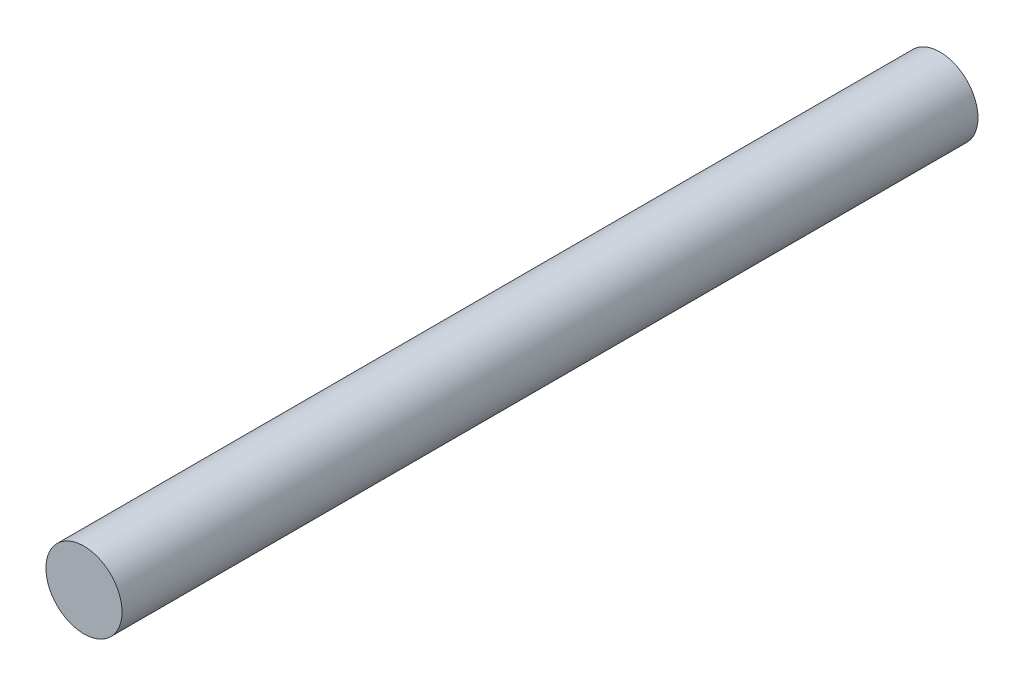
ISO-10303-21;
HEADER;
FILE_DESCRIPTION(('STEP AP214'),'2;1');
FILE_NAME('part.step','',(''),(''),'','','');
FILE_SCHEMA(('AUTOMOTIVE_DESIGN { 1 0 10303 214 1 1 1 1 }'));
ENDSEC;
DATA;
#1=APPLICATION_CONTEXT('core data for automotive mechanical design processes');
#2=APPLICATION_PROTOCOL_DEFINITION('international standard','automotive_design',2000,#1);
#3=PRODUCT_CONTEXT('',#1,'mechanical');
#4=PRODUCT('Part','Part','',(#3));
#5=PRODUCT_RELATED_PRODUCT_CATEGORY('part','',(#4));
#6=PRODUCT_DEFINITION_FORMATION('','',#4);
#7=PRODUCT_DEFINITION_CONTEXT('part definition',#1,'design');
#8=PRODUCT_DEFINITION('design','',#6,#7);
#9=PRODUCT_DEFINITION_SHAPE('','',#8);
#10=(LENGTH_UNIT() NAMED_UNIT(*) SI_UNIT(.MILLI.,.METRE.));
#11=(NAMED_UNIT(*) PLANE_ANGLE_UNIT() SI_UNIT($,.RADIAN.));
#12=(NAMED_UNIT(*) SI_UNIT($,.STERADIAN.) SOLID_ANGLE_UNIT());
#13=UNCERTAINTY_MEASURE_WITH_UNIT(LENGTH_MEASURE(1.E-05),#10,'distance_accuracy_value','');
#14=(GEOMETRIC_REPRESENTATION_CONTEXT(3) GLOBAL_UNCERTAINTY_ASSIGNED_CONTEXT((#13)) GLOBAL_UNIT_ASSIGNED_CONTEXT((#10,
#11,#12)) REPRESENTATION_CONTEXT('',''));
#15=CARTESIAN_POINT('',(0.,0.,0.));
#16=DIRECTION('',(0.,0.,1.));
#17=DIRECTION('',(1.,0.,0.));
#18=AXIS2_PLACEMENT_3D('',#15,#16,#17);
#19=CARTESIAN_POINT('',(0.,0.,45.));
#20=DIRECTION('',(0.,0.,-1.));
#21=DIRECTION('',(-1.,0.,0.));
#22=AXIS2_PLACEMENT_3D('',#19,#20,#21);
#23=CYLINDRICAL_SURFACE('',#22,2.);
#24=CARTESIAN_POINT('',(0.,0.,45.));
#25=DIRECTION('',(0.,0.,1.));
#26=DIRECTION('',(1.,0.,0.));
#27=AXIS2_PLACEMENT_3D('',#24,#25,#26);
#28=CIRCLE('',#27,2.);
#29=CARTESIAN_POINT('',(2.,0.,45.));
#30=VERTEX_POINT('',#29);
#31=EDGE_CURVE('E10',#30,#30,#28,.T.);
#32=ORIENTED_EDGE('',*,*,#31,.F.);
#33=EDGE_LOOP('',(#32));
#34=FACE_BOUND('',#33,.T.);
#35=CARTESIAN_POINT('',(0.,0.,0.));
#36=DIRECTION('',(0.,0.,1.));
#37=DIRECTION('',(1.,0.,0.));
#38=AXIS2_PLACEMENT_3D('',#35,#36,#37);
#39=CIRCLE('',#38,2.);
#40=CARTESIAN_POINT('',(2.,0.,0.));
#41=VERTEX_POINT('',#40);
#42=EDGE_CURVE('E33',#41,#41,#39,.T.);
#43=ORIENTED_EDGE('',*,*,#42,.T.);
#44=EDGE_LOOP('',(#43));
#45=FACE_BOUND('',#44,.T.);
#46=ADVANCED_FACE('F30',(#34,#45),#23,.T.);
#47=CARTESIAN_POINT('',(0.,0.,45.));
#48=DIRECTION('',(0.,0.,1.));
#49=DIRECTION('',(1.,0.,0.));
#50=AXIS2_PLACEMENT_3D('',#47,#48,#49);
#51=PLANE('',#50);
#52=ORIENTED_EDGE('',*,*,#31,.T.);
#53=EDGE_LOOP('',(#52));
#54=FACE_BOUND('',#53,.T.);
#55=ADVANCED_FACE('F45',(#54),#51,.T.);
#56=CARTESIAN_POINT('',(0.,0.,0.));
#57=DIRECTION('',(0.,0.,1.));
#58=DIRECTION('',(1.,0.,0.));
#59=AXIS2_PLACEMENT_3D('',#56,#57,#58);
#60=PLANE('',#59);
#61=ORIENTED_EDGE('',*,*,#42,.F.);
#62=EDGE_LOOP('',(#61));
#63=FACE_BOUND('',#62,.T.);
#64=ADVANCED_FACE('F43',(#63),#60,.F.);
#65=CLOSED_SHELL('',(#46,#55,#64));
#66=MANIFOLD_SOLID_BREP('B2',#65);
#67=ADVANCED_BREP_SHAPE_REPRESENTATION('',(#18,#66),#14);
#68=SHAPE_DEFINITION_REPRESENTATION(#9,#67);
ENDSEC;
END-ISO-10303-21;
